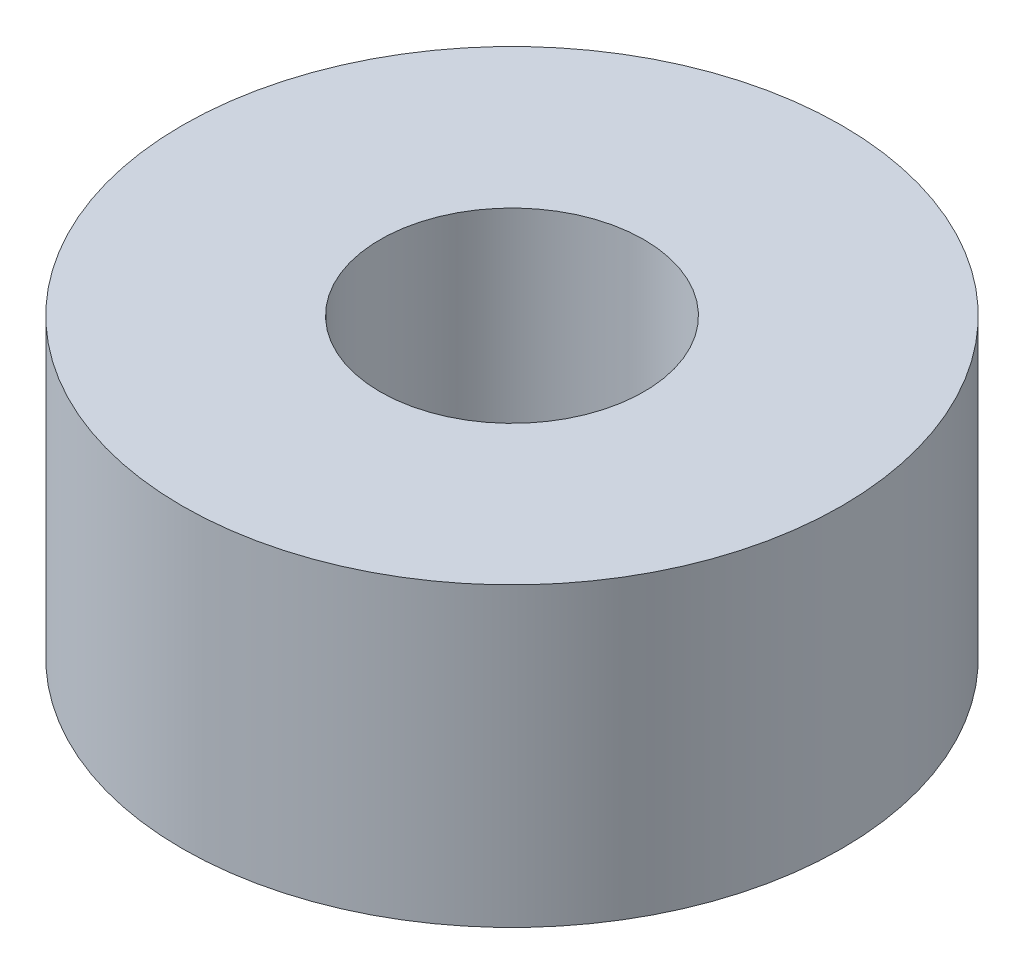
ISO-10303-21;
HEADER;
FILE_DESCRIPTION(('STEP AP214'),'2;1');
FILE_NAME('part.step','',(''),(''),'','','');
FILE_SCHEMA(('AUTOMOTIVE_DESIGN { 1 0 10303 214 1 1 1 1 }'));
ENDSEC;
DATA;
#1=APPLICATION_CONTEXT('core data for automotive mechanical design processes');
#2=APPLICATION_PROTOCOL_DEFINITION('international standard','automotive_design',2000,#1);
#3=PRODUCT_CONTEXT('',#1,'mechanical');
#4=PRODUCT('Part','Part','',(#3));
#5=PRODUCT_RELATED_PRODUCT_CATEGORY('part','',(#4));
#6=PRODUCT_DEFINITION_FORMATION('','',#4);
#7=PRODUCT_DEFINITION_CONTEXT('part definition',#1,'design');
#8=PRODUCT_DEFINITION('design','',#6,#7);
#9=PRODUCT_DEFINITION_SHAPE('','',#8);
#10=(LENGTH_UNIT() NAMED_UNIT(*) SI_UNIT(.MILLI.,.METRE.));
#11=(NAMED_UNIT(*) PLANE_ANGLE_UNIT() SI_UNIT($,.RADIAN.));
#12=(NAMED_UNIT(*) SI_UNIT($,.STERADIAN.) SOLID_ANGLE_UNIT());
#13=UNCERTAINTY_MEASURE_WITH_UNIT(LENGTH_MEASURE(1.E-05),#10,'distance_accuracy_value','');
#14=(GEOMETRIC_REPRESENTATION_CONTEXT(3) GLOBAL_UNCERTAINTY_ASSIGNED_CONTEXT((#13)) GLOBAL_UNIT_ASSIGNED_CONTEXT((#10,
#11,#12)) REPRESENTATION_CONTEXT('',''));
#15=CARTESIAN_POINT('',(0.,0.,0.));
#16=DIRECTION('',(0.,0.,1.));
#17=DIRECTION('',(1.,0.,0.));
#18=AXIS2_PLACEMENT_3D('',#15,#16,#17);
#19=CARTESIAN_POINT('',(0.,4.5,0.));
#20=DIRECTION('',(0.,1.,0.));
#21=DIRECTION('',(0.,0.,1.));
#22=AXIS2_PLACEMENT_3D('',#19,#20,#21);
#23=PLANE('',#22);
#24=CARTESIAN_POINT('',(0.,4.5,0.));
#25=DIRECTION('',(0.,1.,0.));
#26=DIRECTION('',(0.,0.,1.));
#27=AXIS2_PLACEMENT_3D('',#24,#25,#26);
#28=CIRCLE('',#27,5.);
#29=CARTESIAN_POINT('',(0.,4.5,5.));
#30=VERTEX_POINT('',#29);
#31=EDGE_CURVE('E10',#30,#30,#28,.T.);
#32=ORIENTED_EDGE('',*,*,#31,.T.);
#33=EDGE_LOOP('',(#32));
#34=FACE_BOUND('',#33,.T.);
#35=CARTESIAN_POINT('',(0.,4.5,0.));
#36=DIRECTION('',(0.,1.,0.));
#37=DIRECTION('',(0.,0.,1.));
#38=AXIS2_PLACEMENT_3D('',#35,#36,#37);
#39=CIRCLE('',#38,2.);
#40=CARTESIAN_POINT('',(0.,4.5,2.));
#41=VERTEX_POINT('',#40);
#42=EDGE_CURVE('E43',#41,#41,#39,.T.);
#43=ORIENTED_EDGE('',*,*,#42,.F.);
#44=EDGE_LOOP('',(#43));
#45=FACE_BOUND('',#44,.T.);
#46=ADVANCED_FACE('F32',(#34,#45),#23,.T.);
#47=CARTESIAN_POINT('',(0.,0.,0.));
#48=DIRECTION('',(0.,1.,0.));
#49=DIRECTION('',(0.,0.,1.));
#50=AXIS2_PLACEMENT_3D('',#47,#48,#49);
#51=PLANE('',#50);
#52=CARTESIAN_POINT('',(0.,0.,0.));
#53=DIRECTION('',(0.,1.,0.));
#54=DIRECTION('',(0.,0.,1.));
#55=AXIS2_PLACEMENT_3D('',#52,#53,#54);
#56=CIRCLE('',#55,5.);
#57=CARTESIAN_POINT('',(0.,0.,5.));
#58=VERTEX_POINT('',#57);
#59=EDGE_CURVE('E36',#58,#58,#56,.T.);
#60=ORIENTED_EDGE('',*,*,#59,.F.);
#61=EDGE_LOOP('',(#60));
#62=FACE_BOUND('',#61,.T.);
#63=CARTESIAN_POINT('',(0.,0.,0.));
#64=DIRECTION('',(0.,1.,0.));
#65=DIRECTION('',(0.,0.,1.));
#66=AXIS2_PLACEMENT_3D('',#63,#64,#65);
#67=CIRCLE('',#66,2.);
#68=CARTESIAN_POINT('',(0.,0.,2.));
#69=VERTEX_POINT('',#68);
#70=EDGE_CURVE('E45',#69,#69,#67,.T.);
#71=ORIENTED_EDGE('',*,*,#70,.T.);
#72=EDGE_LOOP('',(#71));
#73=FACE_BOUND('',#72,.T.);
#74=ADVANCED_FACE('F55',(#62,#73),#51,.F.);
#75=CARTESIAN_POINT('',(0.,4.5,0.));
#76=DIRECTION('',(0.,-1.,0.));
#77=DIRECTION('',(0.,0.,-1.));
#78=AXIS2_PLACEMENT_3D('',#75,#76,#77);
#79=CYLINDRICAL_SURFACE('',#78,5.);
#80=ORIENTED_EDGE('',*,*,#31,.F.);
#81=EDGE_LOOP('',(#80));
#82=FACE_BOUND('',#81,.T.);
#83=ORIENTED_EDGE('',*,*,#59,.T.);
#84=EDGE_LOOP('',(#83));
#85=FACE_BOUND('',#84,.T.);
#86=ADVANCED_FACE('F34',(#82,#85),#79,.T.);
#87=CARTESIAN_POINT('',(0.,4.5,0.));
#88=DIRECTION('',(0.,-1.,0.));
#89=DIRECTION('',(0.,0.,-1.));
#90=AXIS2_PLACEMENT_3D('',#87,#88,#89);
#91=CYLINDRICAL_SURFACE('',#90,2.);
#92=ORIENTED_EDGE('',*,*,#42,.T.);
#93=EDGE_LOOP('',(#92));
#94=FACE_BOUND('',#93,.T.);
#95=ORIENTED_EDGE('',*,*,#70,.F.);
#96=EDGE_LOOP('',(#95));
#97=FACE_BOUND('',#96,.T.);
#98=ADVANCED_FACE('F51',(#94,#97),#91,.F.);
#99=CLOSED_SHELL('',(#46,#74,#86,#98));
#100=MANIFOLD_SOLID_BREP('B2',#99);
#101=ADVANCED_BREP_SHAPE_REPRESENTATION('',(#18,#100),#14);
#102=SHAPE_DEFINITION_REPRESENTATION(#9,#101);
ENDSEC;
END-ISO-10303-21;
